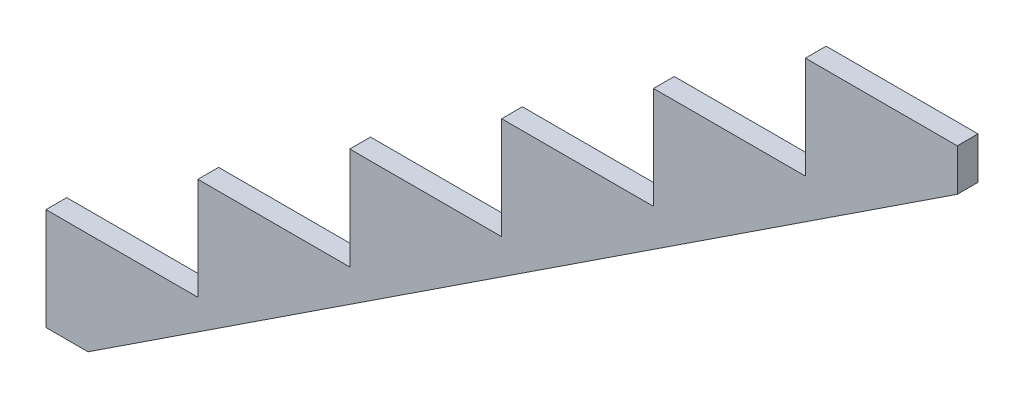
ISO-10303-21;
HEADER;
FILE_DESCRIPTION(('STEP AP214'),'2;1');
FILE_NAME('part.step','',(''),(''),'','','');
FILE_SCHEMA(('AUTOMOTIVE_DESIGN { 1 0 10303 214 1 1 1 1 }'));
ENDSEC;
DATA;
#1=APPLICATION_CONTEXT('core data for automotive mechanical design processes');
#2=APPLICATION_PROTOCOL_DEFINITION('international standard','automotive_design',2000,#1);
#3=PRODUCT_CONTEXT('',#1,'mechanical');
#4=PRODUCT('Part','Part','',(#3));
#5=PRODUCT_RELATED_PRODUCT_CATEGORY('part','',(#4));
#6=PRODUCT_DEFINITION_FORMATION('','',#4);
#7=PRODUCT_DEFINITION_CONTEXT('part definition',#1,'design');
#8=PRODUCT_DEFINITION('design','',#6,#7);
#9=PRODUCT_DEFINITION_SHAPE('','',#8);
#10=(LENGTH_UNIT() NAMED_UNIT(*) SI_UNIT(.MILLI.,.METRE.));
#11=(NAMED_UNIT(*) PLANE_ANGLE_UNIT() SI_UNIT($,.RADIAN.));
#12=(NAMED_UNIT(*) SI_UNIT($,.STERADIAN.) SOLID_ANGLE_UNIT());
#13=UNCERTAINTY_MEASURE_WITH_UNIT(LENGTH_MEASURE(1.E-05),#10,'distance_accuracy_value','');
#14=(GEOMETRIC_REPRESENTATION_CONTEXT(3) GLOBAL_UNCERTAINTY_ASSIGNED_CONTEXT((#13)) GLOBAL_UNIT_ASSIGNED_CONTEXT((#10,
#11,#12)) REPRESENTATION_CONTEXT('',''));
#15=CARTESIAN_POINT('',(0.,0.,0.));
#16=DIRECTION('',(0.,0.,1.));
#17=DIRECTION('',(1.,0.,0.));
#18=AXIS2_PLACEMENT_3D('',#15,#16,#17);
#19=CARTESIAN_POINT('',(0.,0.,38.1));
#20=DIRECTION('',(0.,1.,0.));
#21=DIRECTION('',(0.,0.,1.));
#22=AXIS2_PLACEMENT_3D('',#19,#20,#21);
#23=PLANE('',#22);
#24=DIRECTION('',(1.,0.,0.));
#25=VECTOR('',#24,1.);
#26=CARTESIAN_POINT('',(0.,0.,0.));
#27=LINE('',#26,#25);
#28=CARTESIAN_POINT('',(0.,0.,0.));
#29=VERTEX_POINT('',#28);
#30=CARTESIAN_POINT('',(77.2481540391531,0.,0.));
#31=VERTEX_POINT('',#30);
#32=EDGE_CURVE('E182',#29,#31,#27,.T.);
#33=ORIENTED_EDGE('',*,*,#32,.T.);
#34=DIRECTION('',(0.,0.,-1.));
#35=VECTOR('',#34,1.);
#36=CARTESIAN_POINT('',(77.2481540391531,0.,38.1));
#37=LINE('',#36,#35);
#38=CARTESIAN_POINT('',(77.2481540391531,0.,38.1));
#39=VERTEX_POINT('',#38);
#40=EDGE_CURVE('E11',#39,#31,#37,.T.);
#41=ORIENTED_EDGE('',*,*,#40,.F.);
#42=DIRECTION('',(1.,0.,0.));
#43=VECTOR('',#42,1.);
#44=CARTESIAN_POINT('',(0.,0.,38.1));
#45=LINE('',#44,#43);
#46=CARTESIAN_POINT('',(0.,0.,38.1));
#47=VERTEX_POINT('',#46);
#48=EDGE_CURVE('E225',#47,#39,#45,.T.);
#49=ORIENTED_EDGE('',*,*,#48,.F.);
#50=DIRECTION('',(0.,0.,-1.));
#51=VECTOR('',#50,1.);
#52=CARTESIAN_POINT('',(0.,0.,38.1));
#53=LINE('',#52,#51);
#54=EDGE_CURVE('E178',#47,#29,#53,.T.);
#55=ORIENTED_EDGE('',*,*,#54,.T.);
#56=EDGE_LOOP('',(#33,#41,#49,#55));
#57=FACE_BOUND('',#56,.T.);
#58=ADVANCED_FACE('F39',(#57),#23,.F.);
#59=CARTESIAN_POINT('',(77.2481540391531,0.,38.1));
#60=DIRECTION('',(-0.549046704268654,0.835791670532633,0.));
#61=DIRECTION('',(-0.835791670532633,-0.549046704268654,0.));
#62=AXIS2_PLACEMENT_3D('',#59,#60,#61);
#63=PLANE('',#62);
#64=DIRECTION('',(0.835791670532633,0.549046704268654,0.));
#65=VECTOR('',#64,1.);
#66=CARTESIAN_POINT('',(77.2481540391531,0.,0.));
#67=LINE('',#66,#65);
#68=CARTESIAN_POINT('',(1676.4,1050.51184596085,0.));
#69=VERTEX_POINT('',#68);
#70=EDGE_CURVE('E186',#31,#69,#67,.T.);
#71=ORIENTED_EDGE('',*,*,#70,.T.);
#72=DIRECTION('',(0.,0.,-1.));
#73=VECTOR('',#72,1.);
#74=CARTESIAN_POINT('',(1676.4,1050.51184596085,38.1));
#75=LINE('',#74,#73);
#76=CARTESIAN_POINT('',(1676.4,1050.51184596085,38.1));
#77=VERTEX_POINT('',#76);
#78=EDGE_CURVE('E48',#77,#69,#75,.T.);
#79=ORIENTED_EDGE('',*,*,#78,.F.);
#80=DIRECTION('',(0.835791670532633,0.549046704268654,0.));
#81=VECTOR('',#80,1.);
#82=CARTESIAN_POINT('',(77.2481540391531,0.,38.1));
#83=LINE('',#82,#81);
#84=EDGE_CURVE('E120',#39,#77,#83,.T.);
#85=ORIENTED_EDGE('',*,*,#84,.F.);
#86=ORIENTED_EDGE('',*,*,#40,.T.);
#87=EDGE_LOOP('',(#71,#79,#85,#86));
#88=FACE_BOUND('',#87,.T.);
#89=ADVANCED_FACE('F340',(#88),#63,.F.);
#90=CARTESIAN_POINT('',(1676.4,1127.76,38.1));
#91=DIRECTION('',(-1.,0.,0.));
#92=DIRECTION('',(0.,-1.,0.));
#93=AXIS2_PLACEMENT_3D('',#90,#91,#92);
#94=PLANE('',#93);
#95=DIRECTION('',(0.,1.,0.));
#96=VECTOR('',#95,1.);
#97=CARTESIAN_POINT('',(1676.4,1127.76,0.));
#98=LINE('',#97,#96);
#99=CARTESIAN_POINT('',(1676.4,1127.76,0.));
#100=VERTEX_POINT('',#99);
#101=EDGE_CURVE('E189',#69,#100,#98,.T.);
#102=ORIENTED_EDGE('',*,*,#101,.T.);
#103=DIRECTION('',(0.,0.,-1.));
#104=VECTOR('',#103,1.);
#105=CARTESIAN_POINT('',(1676.4,1127.76,38.1));
#106=LINE('',#105,#104);
#107=CARTESIAN_POINT('',(1676.4,1127.76,38.1));
#108=VERTEX_POINT('',#107);
#109=EDGE_CURVE('E264',#108,#100,#106,.T.);
#110=ORIENTED_EDGE('',*,*,#109,.F.);
#111=DIRECTION('',(0.,1.,0.));
#112=VECTOR('',#111,1.);
#113=CARTESIAN_POINT('',(1676.4,1127.76,38.1));
#114=LINE('',#113,#112);
#115=EDGE_CURVE('E274',#77,#108,#114,.T.);
#116=ORIENTED_EDGE('',*,*,#115,.F.);
#117=ORIENTED_EDGE('',*,*,#78,.T.);
#118=EDGE_LOOP('',(#102,#110,#116,#117));
#119=FACE_BOUND('',#118,.T.);
#120=ADVANCED_FACE('F272',(#119),#94,.F.);
#121=CARTESIAN_POINT('',(1397.,1127.76,38.1));
#122=DIRECTION('',(0.,-1.,0.));
#123=DIRECTION('',(0.,0.,-1.));
#124=AXIS2_PLACEMENT_3D('',#121,#122,#123);
#125=PLANE('',#124);
#126=DIRECTION('',(-1.,0.,0.));
#127=VECTOR('',#126,1.);
#128=CARTESIAN_POINT('',(1397.,1127.76,0.));
#129=LINE('',#128,#127);
#130=CARTESIAN_POINT('',(1397.,1127.76,0.));
#131=VERTEX_POINT('',#130);
#132=EDGE_CURVE('E192',#100,#131,#129,.T.);
#133=ORIENTED_EDGE('',*,*,#132,.T.);
#134=DIRECTION('',(0.,0.,-1.));
#135=VECTOR('',#134,1.);
#136=CARTESIAN_POINT('',(1397.,1127.76,38.1));
#137=LINE('',#136,#135);
#138=CARTESIAN_POINT('',(1397.,1127.76,38.1));
#139=VERTEX_POINT('',#138);
#140=EDGE_CURVE('E260',#139,#131,#137,.T.);
#141=ORIENTED_EDGE('',*,*,#140,.F.);
#142=DIRECTION('',(-1.,0.,0.));
#143=VECTOR('',#142,1.);
#144=CARTESIAN_POINT('',(1397.,1127.76,38.1));
#145=LINE('',#144,#143);
#146=EDGE_CURVE('E293',#108,#139,#145,.T.);
#147=ORIENTED_EDGE('',*,*,#146,.F.);
#148=ORIENTED_EDGE('',*,*,#109,.T.);
#149=EDGE_LOOP('',(#133,#141,#147,#148));
#150=FACE_BOUND('',#149,.T.);
#151=ADVANCED_FACE('F283',(#150),#125,.F.);
#152=CARTESIAN_POINT('',(1397.,939.8,38.1));
#153=DIRECTION('',(1.,0.,0.));
#154=DIRECTION('',(0.,0.,-1.));
#155=AXIS2_PLACEMENT_3D('',#152,#153,#154);
#156=PLANE('',#155);
#157=DIRECTION('',(0.,-1.,0.));
#158=VECTOR('',#157,1.);
#159=CARTESIAN_POINT('',(1397.,939.8,0.));
#160=LINE('',#159,#158);
#161=CARTESIAN_POINT('',(1397.,939.8,0.));
#162=VERTEX_POINT('',#161);
#163=EDGE_CURVE('E195',#131,#162,#160,.T.);
#164=ORIENTED_EDGE('',*,*,#163,.T.);
#165=DIRECTION('',(0.,0.,-1.));
#166=VECTOR('',#165,1.);
#167=CARTESIAN_POINT('',(1397.,939.8,38.1));
#168=LINE('',#167,#166);
#169=CARTESIAN_POINT('',(1397.,939.8,38.1));
#170=VERTEX_POINT('',#169);
#171=EDGE_CURVE('E256',#170,#162,#168,.T.);
#172=ORIENTED_EDGE('',*,*,#171,.F.);
#173=DIRECTION('',(0.,-1.,0.));
#174=VECTOR('',#173,1.);
#175=CARTESIAN_POINT('',(1397.,939.8,38.1));
#176=LINE('',#175,#174);
#177=EDGE_CURVE('E289',#139,#170,#176,.T.);
#178=ORIENTED_EDGE('',*,*,#177,.F.);
#179=ORIENTED_EDGE('',*,*,#140,.T.);
#180=EDGE_LOOP('',(#164,#172,#178,#179));
#181=FACE_BOUND('',#180,.T.);
#182=ADVANCED_FACE('F287',(#181),#156,.F.);
#183=CARTESIAN_POINT('',(1117.6,939.8,38.1));
#184=DIRECTION('',(0.,-1.,0.));
#185=DIRECTION('',(0.,0.,-1.));
#186=AXIS2_PLACEMENT_3D('',#183,#184,#185);
#187=PLANE('',#186);
#188=DIRECTION('',(-1.,0.,0.));
#189=VECTOR('',#188,1.);
#190=CARTESIAN_POINT('',(1117.6,939.8,0.));
#191=LINE('',#190,#189);
#192=CARTESIAN_POINT('',(1117.6,939.8,0.));
#193=VERTEX_POINT('',#192);
#194=EDGE_CURVE('E198',#162,#193,#191,.T.);
#195=ORIENTED_EDGE('',*,*,#194,.T.);
#196=DIRECTION('',(0.,0.,-1.));
#197=VECTOR('',#196,1.);
#198=CARTESIAN_POINT('',(1117.6,939.8,38.1));
#199=LINE('',#198,#197);
#200=CARTESIAN_POINT('',(1117.6,939.8,38.1));
#201=VERTEX_POINT('',#200);
#202=EDGE_CURVE('E252',#201,#193,#199,.T.);
#203=ORIENTED_EDGE('',*,*,#202,.F.);
#204=DIRECTION('',(-1.,0.,0.));
#205=VECTOR('',#204,1.);
#206=CARTESIAN_POINT('',(1117.6,939.8,38.1));
#207=LINE('',#206,#205);
#208=EDGE_CURVE('E292',#170,#201,#207,.T.);
#209=ORIENTED_EDGE('',*,*,#208,.F.);
#210=ORIENTED_EDGE('',*,*,#171,.T.);
#211=EDGE_LOOP('',(#195,#203,#209,#210));
#212=FACE_BOUND('',#211,.T.);
#213=ADVANCED_FACE('F353',(#212),#187,.F.);
#214=CARTESIAN_POINT('',(1117.6,751.84,38.1));
#215=DIRECTION('',(1.,0.,0.));
#216=DIRECTION('',(0.,0.,-1.));
#217=AXIS2_PLACEMENT_3D('',#214,#215,#216);
#218=PLANE('',#217);
#219=DIRECTION('',(0.,-1.,0.));
#220=VECTOR('',#219,1.);
#221=CARTESIAN_POINT('',(1117.6,751.84,0.));
#222=LINE('',#221,#220);
#223=CARTESIAN_POINT('',(1117.6,751.84,0.));
#224=VERTEX_POINT('',#223);
#225=EDGE_CURVE('E201',#193,#224,#222,.T.);
#226=ORIENTED_EDGE('',*,*,#225,.T.);
#227=DIRECTION('',(0.,0.,-1.));
#228=VECTOR('',#227,1.);
#229=CARTESIAN_POINT('',(1117.6,751.84,38.1));
#230=LINE('',#229,#228);
#231=CARTESIAN_POINT('',(1117.6,751.84,38.1));
#232=VERTEX_POINT('',#231);
#233=EDGE_CURVE('E248',#232,#224,#230,.T.);
#234=ORIENTED_EDGE('',*,*,#233,.F.);
#235=DIRECTION('',(0.,-1.,0.));
#236=VECTOR('',#235,1.);
#237=CARTESIAN_POINT('',(1117.6,751.84,38.1));
#238=LINE('',#237,#236);
#239=EDGE_CURVE('E297',#201,#232,#238,.T.);
#240=ORIENTED_EDGE('',*,*,#239,.F.);
#241=ORIENTED_EDGE('',*,*,#202,.T.);
#242=EDGE_LOOP('',(#226,#234,#240,#241));
#243=FACE_BOUND('',#242,.T.);
#244=ADVANCED_FACE('F356',(#243),#218,.F.);
#245=CARTESIAN_POINT('',(838.2,751.84,38.1));
#246=DIRECTION('',(0.,-1.,0.));
#247=DIRECTION('',(0.,0.,-1.));
#248=AXIS2_PLACEMENT_3D('',#245,#246,#247);
#249=PLANE('',#248);
#250=DIRECTION('',(-1.,0.,0.));
#251=VECTOR('',#250,1.);
#252=CARTESIAN_POINT('',(838.2,751.84,0.));
#253=LINE('',#252,#251);
#254=CARTESIAN_POINT('',(838.2,751.84,0.));
#255=VERTEX_POINT('',#254);
#256=EDGE_CURVE('E204',#224,#255,#253,.T.);
#257=ORIENTED_EDGE('',*,*,#256,.T.);
#258=DIRECTION('',(0.,0.,-1.));
#259=VECTOR('',#258,1.);
#260=CARTESIAN_POINT('',(838.2,751.84,38.1));
#261=LINE('',#260,#259);
#262=CARTESIAN_POINT('',(838.2,751.84,38.1));
#263=VERTEX_POINT('',#262);
#264=EDGE_CURVE('E244',#263,#255,#261,.T.);
#265=ORIENTED_EDGE('',*,*,#264,.F.);
#266=DIRECTION('',(-1.,0.,0.));
#267=VECTOR('',#266,1.);
#268=CARTESIAN_POINT('',(838.2,751.84,38.1));
#269=LINE('',#268,#267);
#270=EDGE_CURVE('E304',#232,#263,#269,.T.);
#271=ORIENTED_EDGE('',*,*,#270,.F.);
#272=ORIENTED_EDGE('',*,*,#233,.T.);
#273=EDGE_LOOP('',(#257,#265,#271,#272));
#274=FACE_BOUND('',#273,.T.);
#275=ADVANCED_FACE('F360',(#274),#249,.F.);
#276=CARTESIAN_POINT('',(838.2,563.88,38.1));
#277=DIRECTION('',(1.,0.,0.));
#278=DIRECTION('',(0.,0.,-1.));
#279=AXIS2_PLACEMENT_3D('',#276,#277,#278);
#280=PLANE('',#279);
#281=DIRECTION('',(0.,-1.,0.));
#282=VECTOR('',#281,1.);
#283=CARTESIAN_POINT('',(838.2,563.88,0.));
#284=LINE('',#283,#282);
#285=CARTESIAN_POINT('',(838.2,563.88,0.));
#286=VERTEX_POINT('',#285);
#287=EDGE_CURVE('E207',#255,#286,#284,.T.);
#288=ORIENTED_EDGE('',*,*,#287,.T.);
#289=DIRECTION('',(0.,0.,-1.));
#290=VECTOR('',#289,1.);
#291=CARTESIAN_POINT('',(838.2,563.88,38.1));
#292=LINE('',#291,#290);
#293=CARTESIAN_POINT('',(838.2,563.88,38.1));
#294=VERTEX_POINT('',#293);
#295=EDGE_CURVE('E240',#294,#286,#292,.T.);
#296=ORIENTED_EDGE('',*,*,#295,.F.);
#297=DIRECTION('',(0.,-1.,0.));
#298=VECTOR('',#297,1.);
#299=CARTESIAN_POINT('',(838.2,563.88,38.1));
#300=LINE('',#299,#298);
#301=EDGE_CURVE('E307',#263,#294,#300,.T.);
#302=ORIENTED_EDGE('',*,*,#301,.F.);
#303=ORIENTED_EDGE('',*,*,#264,.T.);
#304=EDGE_LOOP('',(#288,#296,#302,#303));
#305=FACE_BOUND('',#304,.T.);
#306=ADVANCED_FACE('F364',(#305),#280,.F.);
#307=CARTESIAN_POINT('',(558.8,563.88,38.1));
#308=DIRECTION('',(0.,-1.,0.));
#309=DIRECTION('',(0.,0.,-1.));
#310=AXIS2_PLACEMENT_3D('',#307,#308,#309);
#311=PLANE('',#310);
#312=DIRECTION('',(-1.,0.,0.));
#313=VECTOR('',#312,1.);
#314=CARTESIAN_POINT('',(558.8,563.88,0.));
#315=LINE('',#314,#313);
#316=CARTESIAN_POINT('',(558.8,563.88,0.));
#317=VERTEX_POINT('',#316);
#318=EDGE_CURVE('E210',#286,#317,#315,.T.);
#319=ORIENTED_EDGE('',*,*,#318,.T.);
#320=DIRECTION('',(0.,0.,-1.));
#321=VECTOR('',#320,1.);
#322=CARTESIAN_POINT('',(558.8,563.88,38.1));
#323=LINE('',#322,#321);
#324=CARTESIAN_POINT('',(558.8,563.88,38.1));
#325=VERTEX_POINT('',#324);
#326=EDGE_CURVE('E236',#325,#317,#323,.T.);
#327=ORIENTED_EDGE('',*,*,#326,.F.);
#328=DIRECTION('',(-1.,0.,0.));
#329=VECTOR('',#328,1.);
#330=CARTESIAN_POINT('',(558.8,563.88,38.1));
#331=LINE('',#330,#329);
#332=EDGE_CURVE('E310',#294,#325,#331,.T.);
#333=ORIENTED_EDGE('',*,*,#332,.F.);
#334=ORIENTED_EDGE('',*,*,#295,.T.);
#335=EDGE_LOOP('',(#319,#327,#333,#334));
#336=FACE_BOUND('',#335,.T.);
#337=ADVANCED_FACE('F368',(#336),#311,.F.);
#338=CARTESIAN_POINT('',(558.8,375.92,38.1));
#339=DIRECTION('',(1.,0.,0.));
#340=DIRECTION('',(0.,0.,-1.));
#341=AXIS2_PLACEMENT_3D('',#338,#339,#340);
#342=PLANE('',#341);
#343=DIRECTION('',(0.,-1.,0.));
#344=VECTOR('',#343,1.);
#345=CARTESIAN_POINT('',(558.8,375.92,0.));
#346=LINE('',#345,#344);
#347=CARTESIAN_POINT('',(558.8,375.92,0.));
#348=VERTEX_POINT('',#347);
#349=EDGE_CURVE('E213',#317,#348,#346,.T.);
#350=ORIENTED_EDGE('',*,*,#349,.T.);
#351=DIRECTION('',(0.,0.,-1.));
#352=VECTOR('',#351,1.);
#353=CARTESIAN_POINT('',(558.8,375.92,38.1));
#354=LINE('',#353,#352);
#355=CARTESIAN_POINT('',(558.8,375.92,38.1));
#356=VERTEX_POINT('',#355);
#357=EDGE_CURVE('E232',#356,#348,#354,.T.);
#358=ORIENTED_EDGE('',*,*,#357,.F.);
#359=DIRECTION('',(0.,-1.,0.));
#360=VECTOR('',#359,1.);
#361=CARTESIAN_POINT('',(558.8,375.92,38.1));
#362=LINE('',#361,#360);
#363=EDGE_CURVE('E313',#325,#356,#362,.T.);
#364=ORIENTED_EDGE('',*,*,#363,.F.);
#365=ORIENTED_EDGE('',*,*,#326,.T.);
#366=EDGE_LOOP('',(#350,#358,#364,#365));
#367=FACE_BOUND('',#366,.T.);
#368=ADVANCED_FACE('F321',(#367),#342,.F.);
#369=CARTESIAN_POINT('',(279.4,375.92,38.1));
#370=DIRECTION('',(0.,-1.,0.));
#371=DIRECTION('',(0.,0.,-1.));
#372=AXIS2_PLACEMENT_3D('',#369,#370,#371);
#373=PLANE('',#372);
#374=DIRECTION('',(-1.,0.,0.));
#375=VECTOR('',#374,1.);
#376=CARTESIAN_POINT('',(279.4,375.92,0.));
#377=LINE('',#376,#375);
#378=CARTESIAN_POINT('',(279.4,375.92,0.));
#379=VERTEX_POINT('',#378);
#380=EDGE_CURVE('E216',#348,#379,#377,.T.);
#381=ORIENTED_EDGE('',*,*,#380,.T.);
#382=DIRECTION('',(0.,0.,-1.));
#383=VECTOR('',#382,1.);
#384=CARTESIAN_POINT('',(279.4,375.92,38.1));
#385=LINE('',#384,#383);
#386=CARTESIAN_POINT('',(279.4,375.92,38.1));
#387=VERTEX_POINT('',#386);
#388=EDGE_CURVE('E171',#387,#379,#385,.T.);
#389=ORIENTED_EDGE('',*,*,#388,.F.);
#390=DIRECTION('',(-1.,0.,0.));
#391=VECTOR('',#390,1.);
#392=CARTESIAN_POINT('',(279.4,375.92,38.1));
#393=LINE('',#392,#391);
#394=EDGE_CURVE('E160',#356,#387,#393,.T.);
#395=ORIENTED_EDGE('',*,*,#394,.F.);
#396=ORIENTED_EDGE('',*,*,#357,.T.);
#397=EDGE_LOOP('',(#381,#389,#395,#396));
#398=FACE_BOUND('',#397,.T.);
#399=ADVANCED_FACE('F325',(#398),#373,.F.);
#400=CARTESIAN_POINT('',(279.4,187.96,38.1));
#401=DIRECTION('',(1.,0.,0.));
#402=DIRECTION('',(0.,0.,-1.));
#403=AXIS2_PLACEMENT_3D('',#400,#401,#402);
#404=PLANE('',#403);
#405=DIRECTION('',(0.,-1.,0.));
#406=VECTOR('',#405,1.);
#407=CARTESIAN_POINT('',(279.4,187.96,0.));
#408=LINE('',#407,#406);
#409=CARTESIAN_POINT('',(279.4,187.96,0.));
#410=VERTEX_POINT('',#409);
#411=EDGE_CURVE('E169',#379,#410,#408,.T.);
#412=ORIENTED_EDGE('',*,*,#411,.T.);
#413=DIRECTION('',(0.,0.,-1.));
#414=VECTOR('',#413,1.);
#415=CARTESIAN_POINT('',(279.4,187.96,38.1));
#416=LINE('',#415,#414);
#417=CARTESIAN_POINT('',(279.4,187.96,38.1));
#418=VERTEX_POINT('',#417);
#419=EDGE_CURVE('E166',#418,#410,#416,.T.);
#420=ORIENTED_EDGE('',*,*,#419,.F.);
#421=DIRECTION('',(0.,-1.,0.));
#422=VECTOR('',#421,1.);
#423=CARTESIAN_POINT('',(279.4,187.96,38.1));
#424=LINE('',#423,#422);
#425=EDGE_CURVE('E154',#387,#418,#424,.T.);
#426=ORIENTED_EDGE('',*,*,#425,.F.);
#427=ORIENTED_EDGE('',*,*,#388,.T.);
#428=EDGE_LOOP('',(#412,#420,#426,#427));
#429=FACE_BOUND('',#428,.T.);
#430=ADVANCED_FACE('F167',(#429),#404,.F.);
#431=CARTESIAN_POINT('',(0.,187.96,38.1));
#432=DIRECTION('',(0.,-1.,0.));
#433=DIRECTION('',(0.,0.,-1.));
#434=AXIS2_PLACEMENT_3D('',#431,#432,#433);
#435=PLANE('',#434);
#436=DIRECTION('',(-1.,0.,0.));
#437=VECTOR('',#436,1.);
#438=CARTESIAN_POINT('',(0.,187.96,0.));
#439=LINE('',#438,#437);
#440=CARTESIAN_POINT('',(0.,187.96,0.));
#441=VERTEX_POINT('',#440);
#442=EDGE_CURVE('E106',#410,#441,#439,.T.);
#443=ORIENTED_EDGE('',*,*,#442,.T.);
#444=DIRECTION('',(0.,0.,-1.));
#445=VECTOR('',#444,1.);
#446=CARTESIAN_POINT('',(0.,187.96,38.1));
#447=LINE('',#446,#445);
#448=CARTESIAN_POINT('',(0.,187.96,38.1));
#449=VERTEX_POINT('',#448);
#450=EDGE_CURVE('E172',#449,#441,#447,.T.);
#451=ORIENTED_EDGE('',*,*,#450,.F.);
#452=DIRECTION('',(-1.,0.,0.));
#453=VECTOR('',#452,1.);
#454=CARTESIAN_POINT('',(0.,187.96,38.1));
#455=LINE('',#454,#453);
#456=EDGE_CURVE('E158',#418,#449,#455,.T.);
#457=ORIENTED_EDGE('',*,*,#456,.F.);
#458=ORIENTED_EDGE('',*,*,#419,.T.);
#459=EDGE_LOOP('',(#443,#451,#457,#458));
#460=FACE_BOUND('',#459,.T.);
#461=ADVANCED_FACE('F174',(#460),#435,.F.);
#462=CARTESIAN_POINT('',(0.,187.96,38.1));
#463=DIRECTION('',(1.,0.,0.));
#464=DIRECTION('',(0.,0.,-1.));
#465=AXIS2_PLACEMENT_3D('',#462,#463,#464);
#466=PLANE('',#465);
#467=DIRECTION('',(0.,-1.,0.));
#468=VECTOR('',#467,1.);
#469=CARTESIAN_POINT('',(0.,187.96,0.));
#470=LINE('',#469,#468);
#471=EDGE_CURVE('E112',#441,#29,#470,.T.);
#472=ORIENTED_EDGE('',*,*,#471,.T.);
#473=ORIENTED_EDGE('',*,*,#54,.F.);
#474=DIRECTION('',(0.,-1.,0.));
#475=VECTOR('',#474,1.);
#476=CARTESIAN_POINT('',(0.,187.96,38.1));
#477=LINE('',#476,#475);
#478=EDGE_CURVE('E56',#449,#47,#477,.T.);
#479=ORIENTED_EDGE('',*,*,#478,.F.);
#480=ORIENTED_EDGE('',*,*,#450,.T.);
#481=EDGE_LOOP('',(#472,#473,#479,#480));
#482=FACE_BOUND('',#481,.T.);
#483=ADVANCED_FACE('F329',(#482),#466,.F.);
#484=CARTESIAN_POINT('',(0.,0.,38.1));
#485=DIRECTION('',(0.,0.,-1.));
#486=DIRECTION('',(-1.,0.,0.));
#487=AXIS2_PLACEMENT_3D('',#484,#485,#486);
#488=PLANE('',#487);
#489=ORIENTED_EDGE('',*,*,#48,.T.);
#490=ORIENTED_EDGE('',*,*,#84,.T.);
#491=ORIENTED_EDGE('',*,*,#115,.T.);
#492=ORIENTED_EDGE('',*,*,#146,.T.);
#493=ORIENTED_EDGE('',*,*,#177,.T.);
#494=ORIENTED_EDGE('',*,*,#208,.T.);
#495=ORIENTED_EDGE('',*,*,#239,.T.);
#496=ORIENTED_EDGE('',*,*,#270,.T.);
#497=ORIENTED_EDGE('',*,*,#301,.T.);
#498=ORIENTED_EDGE('',*,*,#332,.T.);
#499=ORIENTED_EDGE('',*,*,#363,.T.);
#500=ORIENTED_EDGE('',*,*,#394,.T.);
#501=ORIENTED_EDGE('',*,*,#425,.T.);
#502=ORIENTED_EDGE('',*,*,#456,.T.);
#503=ORIENTED_EDGE('',*,*,#478,.T.);
#504=EDGE_LOOP('',(#489,#490,#491,#492,#493,#494,#495,#496,#497,#498,#499,#500,#501,#502,#503));
#505=FACE_BOUND('',#504,.T.);
#506=ADVANCED_FACE('F156',(#505),#488,.F.);
#507=CARTESIAN_POINT('',(0.,0.,0.));
#508=DIRECTION('',(0.,0.,-1.));
#509=DIRECTION('',(-1.,0.,0.));
#510=AXIS2_PLACEMENT_3D('',#507,#508,#509);
#511=PLANE('',#510);
#512=ORIENTED_EDGE('',*,*,#32,.F.);
#513=ORIENTED_EDGE('',*,*,#471,.F.);
#514=ORIENTED_EDGE('',*,*,#442,.F.);
#515=ORIENTED_EDGE('',*,*,#411,.F.);
#516=ORIENTED_EDGE('',*,*,#380,.F.);
#517=ORIENTED_EDGE('',*,*,#349,.F.);
#518=ORIENTED_EDGE('',*,*,#318,.F.);
#519=ORIENTED_EDGE('',*,*,#287,.F.);
#520=ORIENTED_EDGE('',*,*,#256,.F.);
#521=ORIENTED_EDGE('',*,*,#225,.F.);
#522=ORIENTED_EDGE('',*,*,#194,.F.);
#523=ORIENTED_EDGE('',*,*,#163,.F.);
#524=ORIENTED_EDGE('',*,*,#132,.F.);
#525=ORIENTED_EDGE('',*,*,#101,.F.);
#526=ORIENTED_EDGE('',*,*,#70,.F.);
#527=EDGE_LOOP('',(#512,#513,#514,#515,#516,#517,#518,#519,#520,#521,#522,#523,#524,#525,#526));
#528=FACE_BOUND('',#527,.T.);
#529=ADVANCED_FACE('F278',(#528),#511,.T.);
#530=CLOSED_SHELL('',(#58,#89,#120,#151,#182,#213,#244,#275,#306,#337,#368,#399,#430,#461,#483,
#506,#529));
#531=MANIFOLD_SOLID_BREP('B2',#530);
#532=ADVANCED_BREP_SHAPE_REPRESENTATION('',(#18,#531),#14);
#533=SHAPE_DEFINITION_REPRESENTATION(#9,#532);
ENDSEC;
END-ISO-10303-21;
